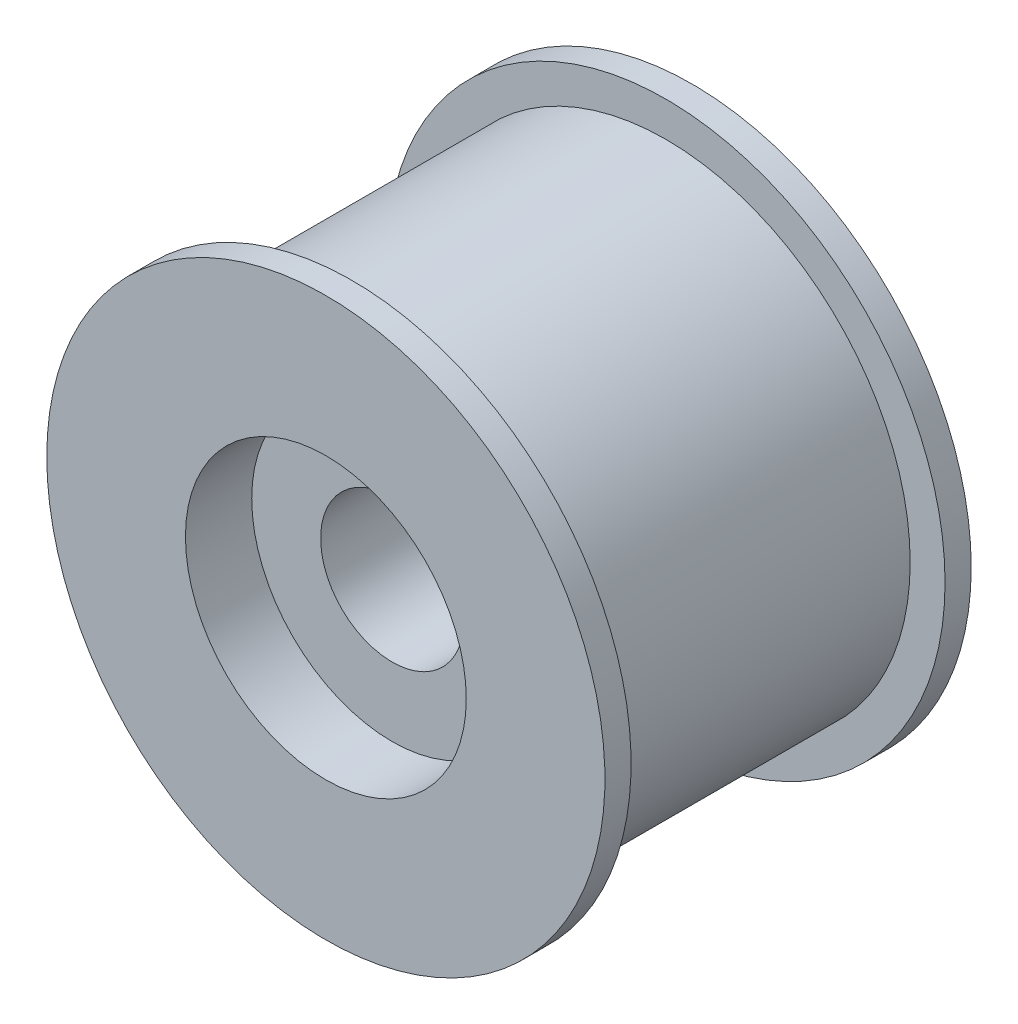
ISO-10303-21;
HEADER;
FILE_DESCRIPTION(('STEP AP214'),'2;1');
FILE_NAME('part.step','',(''),(''),'','','');
FILE_SCHEMA(('AUTOMOTIVE_DESIGN { 1 0 10303 214 1 1 1 1 }'));
ENDSEC;
DATA;
#1=APPLICATION_CONTEXT('core data for automotive mechanical design processes');
#2=APPLICATION_PROTOCOL_DEFINITION('international standard','automotive_design',2000,#1);
#3=PRODUCT_CONTEXT('',#1,'mechanical');
#4=PRODUCT('Part','Part','',(#3));
#5=PRODUCT_RELATED_PRODUCT_CATEGORY('part','',(#4));
#6=PRODUCT_DEFINITION_FORMATION('','',#4);
#7=PRODUCT_DEFINITION_CONTEXT('part definition',#1,'design');
#8=PRODUCT_DEFINITION('design','',#6,#7);
#9=PRODUCT_DEFINITION_SHAPE('','',#8);
#10=(LENGTH_UNIT() NAMED_UNIT(*) SI_UNIT(.MILLI.,.METRE.));
#11=(NAMED_UNIT(*) PLANE_ANGLE_UNIT() SI_UNIT($,.RADIAN.));
#12=(NAMED_UNIT(*) SI_UNIT($,.STERADIAN.) SOLID_ANGLE_UNIT());
#13=UNCERTAINTY_MEASURE_WITH_UNIT(LENGTH_MEASURE(1.E-05),#10,'distance_accuracy_value','');
#14=(GEOMETRIC_REPRESENTATION_CONTEXT(3) GLOBAL_UNCERTAINTY_ASSIGNED_CONTEXT((#13)) GLOBAL_UNIT_ASSIGNED_CONTEXT((#10,
#11,#12)) REPRESENTATION_CONTEXT('',''));
#15=CARTESIAN_POINT('',(0.,0.,0.));
#16=DIRECTION('',(0.,0.,1.));
#17=DIRECTION('',(1.,0.,0.));
#18=AXIS2_PLACEMENT_3D('',#15,#16,#17);
#19=CARTESIAN_POINT('',(0.,0.,21.));
#20=DIRECTION('',(0.,0.,-1.));
#21=DIRECTION('',(-1.,0.,0.));
#22=AXIS2_PLACEMENT_3D('',#19,#20,#21);
#23=CYLINDRICAL_SURFACE('',#22,4.1);
#24=CARTESIAN_POINT('',(0.,0.,3.8));
#25=DIRECTION('',(0.,0.,1.));
#26=DIRECTION('',(1.,0.,0.));
#27=AXIS2_PLACEMENT_3D('',#24,#25,#26);
#28=CIRCLE('',#27,4.1);
#29=CARTESIAN_POINT('',(4.1,0.,3.8));
#30=VERTEX_POINT('',#29);
#31=EDGE_CURVE('E36',#30,#30,#28,.T.);
#32=ORIENTED_EDGE('',*,*,#31,.F.);
#33=EDGE_LOOP('',(#32));
#34=FACE_BOUND('',#33,.T.);
#35=CARTESIAN_POINT('',(0.,0.,17.2));
#36=DIRECTION('',(0.,0.,1.));
#37=DIRECTION('',(1.,0.,0.));
#38=AXIS2_PLACEMENT_3D('',#35,#36,#37);
#39=CIRCLE('',#38,4.1);
#40=CARTESIAN_POINT('',(4.1,0.,17.2));
#41=VERTEX_POINT('',#40);
#42=EDGE_CURVE('E52',#41,#41,#39,.T.);
#43=ORIENTED_EDGE('',*,*,#42,.T.);
#44=EDGE_LOOP('',(#43));
#45=FACE_BOUND('',#44,.T.);
#46=ADVANCED_FACE('F32',(#34,#45),#23,.F.);
#47=CARTESIAN_POINT('',(0.,0.,21.));
#48=DIRECTION('',(0.,0.,1.));
#49=DIRECTION('',(1.,0.,0.));
#50=AXIS2_PLACEMENT_3D('',#47,#48,#49);
#51=PLANE('',#50);
#52=CARTESIAN_POINT('',(0.,0.,21.));
#53=DIRECTION('',(0.,0.,1.));
#54=DIRECTION('',(1.,0.,0.));
#55=AXIS2_PLACEMENT_3D('',#52,#53,#54);
#56=CIRCLE('',#55,8.05);
#57=CARTESIAN_POINT('',(8.05,0.,21.));
#58=VERTEX_POINT('',#57);
#59=EDGE_CURVE('E61',#58,#58,#56,.T.);
#60=ORIENTED_EDGE('',*,*,#59,.F.);
#61=EDGE_LOOP('',(#60));
#62=FACE_BOUND('',#61,.T.);
#63=CARTESIAN_POINT('',(0.,0.,21.));
#64=DIRECTION('',(0.,0.,-1.));
#65=DIRECTION('',(-1.,0.,0.));
#66=AXIS2_PLACEMENT_3D('',#63,#64,#65);
#67=CIRCLE('',#66,16.);
#68=CARTESIAN_POINT('',(-16.,0.,21.));
#69=VERTEX_POINT('',#68);
#70=EDGE_CURVE('E45',#69,#69,#67,.T.);
#71=ORIENTED_EDGE('',*,*,#70,.F.);
#72=EDGE_LOOP('',(#71));
#73=FACE_BOUND('',#72,.T.);
#74=ADVANCED_FACE('F85',(#62,#73),#51,.T.);
#75=CARTESIAN_POINT('',(0.,0.,0.));
#76=DIRECTION('',(0.,0.,1.));
#77=DIRECTION('',(1.,0.,0.));
#78=AXIS2_PLACEMENT_3D('',#75,#76,#77);
#79=PLANE('',#78);
#80=CARTESIAN_POINT('',(0.,0.,0.));
#81=DIRECTION('',(0.,0.,1.));
#82=DIRECTION('',(1.,0.,0.));
#83=AXIS2_PLACEMENT_3D('',#80,#81,#82);
#84=CIRCLE('',#83,8.05);
#85=CARTESIAN_POINT('',(8.05,0.,0.));
#86=VERTEX_POINT('',#85);
#87=EDGE_CURVE('E68',#86,#86,#84,.T.);
#88=ORIENTED_EDGE('',*,*,#87,.T.);
#89=EDGE_LOOP('',(#88));
#90=FACE_BOUND('',#89,.T.);
#91=CARTESIAN_POINT('',(0.,0.,0.));
#92=DIRECTION('',(0.,0.,1.));
#93=DIRECTION('',(1.,0.,0.));
#94=AXIS2_PLACEMENT_3D('',#91,#92,#93);
#95=CIRCLE('',#94,16.);
#96=CARTESIAN_POINT('',(16.,0.,0.));
#97=VERTEX_POINT('',#96);
#98=EDGE_CURVE('E54',#97,#97,#95,.T.);
#99=ORIENTED_EDGE('',*,*,#98,.F.);
#100=EDGE_LOOP('',(#99));
#101=FACE_BOUND('',#100,.T.);
#102=ADVANCED_FACE('F83',(#90,#101),#79,.F.);
#103=CARTESIAN_POINT('',(0.,0.,21.));
#104=DIRECTION('',(0.,0.,-1.));
#105=DIRECTION('',(-1.,0.,0.));
#106=AXIS2_PLACEMENT_3D('',#103,#104,#105);
#107=CYLINDRICAL_SURFACE('',#106,14.);
#108=CARTESIAN_POINT('',(0.,0.,1.5));
#109=DIRECTION('',(0.,0.,1.));
#110=DIRECTION('',(1.,0.,0.));
#111=AXIS2_PLACEMENT_3D('',#108,#109,#110);
#112=CIRCLE('',#111,14.);
#113=CARTESIAN_POINT('',(14.,0.,1.5));
#114=VERTEX_POINT('',#113);
#115=EDGE_CURVE('E49',#114,#114,#112,.T.);
#116=ORIENTED_EDGE('',*,*,#115,.T.);
#117=EDGE_LOOP('',(#116));
#118=FACE_BOUND('',#117,.T.);
#119=CARTESIAN_POINT('',(0.,0.,19.5));
#120=DIRECTION('',(0.,0.,-1.));
#121=DIRECTION('',(-1.,0.,0.));
#122=AXIS2_PLACEMENT_3D('',#119,#120,#121);
#123=CIRCLE('',#122,14.);
#124=CARTESIAN_POINT('',(-14.,0.,19.5));
#125=VERTEX_POINT('',#124);
#126=EDGE_CURVE('E10',#125,#125,#123,.T.);
#127=ORIENTED_EDGE('',*,*,#126,.T.);
#128=EDGE_LOOP('',(#127));
#129=FACE_BOUND('',#128,.T.);
#130=ADVANCED_FACE('F34',(#118,#129),#107,.T.);
#131=CARTESIAN_POINT('',(0.,0.,19.5));
#132=DIRECTION('',(0.,0.,-1.));
#133=DIRECTION('',(-1.,0.,0.));
#134=AXIS2_PLACEMENT_3D('',#131,#132,#133);
#135=PLANE('',#134);
#136=ORIENTED_EDGE('',*,*,#126,.F.);
#137=EDGE_LOOP('',(#136));
#138=FACE_BOUND('',#137,.T.);
#139=CARTESIAN_POINT('',(0.,0.,19.5));
#140=DIRECTION('',(0.,0.,-1.));
#141=DIRECTION('',(-1.,0.,0.));
#142=AXIS2_PLACEMENT_3D('',#139,#140,#141);
#143=CIRCLE('',#142,16.);
#144=CARTESIAN_POINT('',(-16.,0.,19.5));
#145=VERTEX_POINT('',#144);
#146=EDGE_CURVE('E40',#145,#145,#143,.T.);
#147=ORIENTED_EDGE('',*,*,#146,.T.);
#148=EDGE_LOOP('',(#147));
#149=FACE_BOUND('',#148,.T.);
#150=ADVANCED_FACE('F91',(#138,#149),#135,.T.);
#151=CARTESIAN_POINT('',(0.,0.,19.5));
#152=DIRECTION('',(0.,0.,1.));
#153=DIRECTION('',(1.,0.,0.));
#154=AXIS2_PLACEMENT_3D('',#151,#152,#153);
#155=CYLINDRICAL_SURFACE('',#154,16.);
#156=ORIENTED_EDGE('',*,*,#146,.F.);
#157=EDGE_LOOP('',(#156));
#158=FACE_BOUND('',#157,.T.);
#159=ORIENTED_EDGE('',*,*,#70,.T.);
#160=EDGE_LOOP('',(#159));
#161=FACE_BOUND('',#160,.T.);
#162=ADVANCED_FACE('F103',(#158,#161),#155,.T.);
#163=CARTESIAN_POINT('',(0.,0.,1.5));
#164=DIRECTION('',(0.,0.,1.));
#165=DIRECTION('',(1.,0.,0.));
#166=AXIS2_PLACEMENT_3D('',#163,#164,#165);
#167=PLANE('',#166);
#168=ORIENTED_EDGE('',*,*,#115,.F.);
#169=EDGE_LOOP('',(#168));
#170=FACE_BOUND('',#169,.T.);
#171=CARTESIAN_POINT('',(0.,0.,1.5));
#172=DIRECTION('',(0.,0.,1.));
#173=DIRECTION('',(1.,0.,0.));
#174=AXIS2_PLACEMENT_3D('',#171,#172,#173);
#175=CIRCLE('',#174,16.);
#176=CARTESIAN_POINT('',(16.,0.,1.5));
#177=VERTEX_POINT('',#176);
#178=EDGE_CURVE('E51',#177,#177,#175,.T.);
#179=ORIENTED_EDGE('',*,*,#178,.T.);
#180=EDGE_LOOP('',(#179));
#181=FACE_BOUND('',#180,.T.);
#182=ADVANCED_FACE('F74',(#170,#181),#167,.T.);
#183=CARTESIAN_POINT('',(0.,0.,1.5));
#184=DIRECTION('',(0.,0.,-1.));
#185=DIRECTION('',(-1.,0.,0.));
#186=AXIS2_PLACEMENT_3D('',#183,#184,#185);
#187=CYLINDRICAL_SURFACE('',#186,16.);
#188=ORIENTED_EDGE('',*,*,#178,.F.);
#189=EDGE_LOOP('',(#188));
#190=FACE_BOUND('',#189,.T.);
#191=ORIENTED_EDGE('',*,*,#98,.T.);
#192=EDGE_LOOP('',(#191));
#193=FACE_BOUND('',#192,.T.);
#194=ADVANCED_FACE('F76',(#190,#193),#187,.T.);
#195=CARTESIAN_POINT('',(0.,0.,17.2));
#196=DIRECTION('',(0.,0.,1.));
#197=DIRECTION('',(1.,0.,0.));
#198=AXIS2_PLACEMENT_3D('',#195,#196,#197);
#199=CYLINDRICAL_SURFACE('',#198,8.05);
#200=CARTESIAN_POINT('',(0.,0.,17.2));
#201=DIRECTION('',(0.,0.,1.));
#202=DIRECTION('',(1.,0.,0.));
#203=AXIS2_PLACEMENT_3D('',#200,#201,#202);
#204=CIRCLE('',#203,8.05);
#205=CARTESIAN_POINT('',(8.05,0.,17.2));
#206=VERTEX_POINT('',#205);
#207=EDGE_CURVE('E55',#206,#206,#204,.T.);
#208=ORIENTED_EDGE('',*,*,#207,.F.);
#209=EDGE_LOOP('',(#208));
#210=FACE_BOUND('',#209,.T.);
#211=ORIENTED_EDGE('',*,*,#59,.T.);
#212=EDGE_LOOP('',(#211));
#213=FACE_BOUND('',#212,.T.);
#214=ADVANCED_FACE('F79',(#210,#213),#199,.F.);
#215=CARTESIAN_POINT('',(0.,0.,17.2));
#216=DIRECTION('',(0.,0.,1.));
#217=DIRECTION('',(1.,0.,0.));
#218=AXIS2_PLACEMENT_3D('',#215,#216,#217);
#219=PLANE('',#218);
#220=ORIENTED_EDGE('',*,*,#42,.F.);
#221=EDGE_LOOP('',(#220));
#222=FACE_BOUND('',#221,.T.);
#223=ORIENTED_EDGE('',*,*,#207,.T.);
#224=EDGE_LOOP('',(#223));
#225=FACE_BOUND('',#224,.T.);
#226=ADVANCED_FACE('F115',(#222,#225),#219,.T.);
#227=CARTESIAN_POINT('',(0.,0.,3.8));
#228=DIRECTION('',(0.,0.,-1.));
#229=DIRECTION('',(-1.,0.,0.));
#230=AXIS2_PLACEMENT_3D('',#227,#228,#229);
#231=CYLINDRICAL_SURFACE('',#230,8.05);
#232=CARTESIAN_POINT('',(0.,0.,3.8));
#233=DIRECTION('',(0.,0.,1.));
#234=DIRECTION('',(1.,0.,0.));
#235=AXIS2_PLACEMENT_3D('',#232,#233,#234);
#236=CIRCLE('',#235,8.05);
#237=CARTESIAN_POINT('',(8.05,0.,3.8));
#238=VERTEX_POINT('',#237);
#239=EDGE_CURVE('E133',#238,#238,#236,.T.);
#240=ORIENTED_EDGE('',*,*,#239,.T.);
#241=EDGE_LOOP('',(#240));
#242=FACE_BOUND('',#241,.T.);
#243=ORIENTED_EDGE('',*,*,#87,.F.);
#244=EDGE_LOOP('',(#243));
#245=FACE_BOUND('',#244,.T.);
#246=ADVANCED_FACE('F119',(#242,#245),#231,.F.);
#247=CARTESIAN_POINT('',(0.,0.,3.8));
#248=DIRECTION('',(0.,0.,1.));
#249=DIRECTION('',(1.,0.,0.));
#250=AXIS2_PLACEMENT_3D('',#247,#248,#249);
#251=PLANE('',#250);
#252=ORIENTED_EDGE('',*,*,#31,.T.);
#253=EDGE_LOOP('',(#252));
#254=FACE_BOUND('',#253,.T.);
#255=ORIENTED_EDGE('',*,*,#239,.F.);
#256=EDGE_LOOP('',(#255));
#257=FACE_BOUND('',#256,.T.);
#258=ADVANCED_FACE('F123',(#254,#257),#251,.F.);
#259=CLOSED_SHELL('',(#46,#74,#102,#130,#150,#162,#182,#194,#214,#226,#246,#258));
#260=MANIFOLD_SOLID_BREP('B2',#259);
#261=ADVANCED_BREP_SHAPE_REPRESENTATION('',(#18,#260),#14);
#262=SHAPE_DEFINITION_REPRESENTATION(#9,#261);
ENDSEC;
END-ISO-10303-21;
